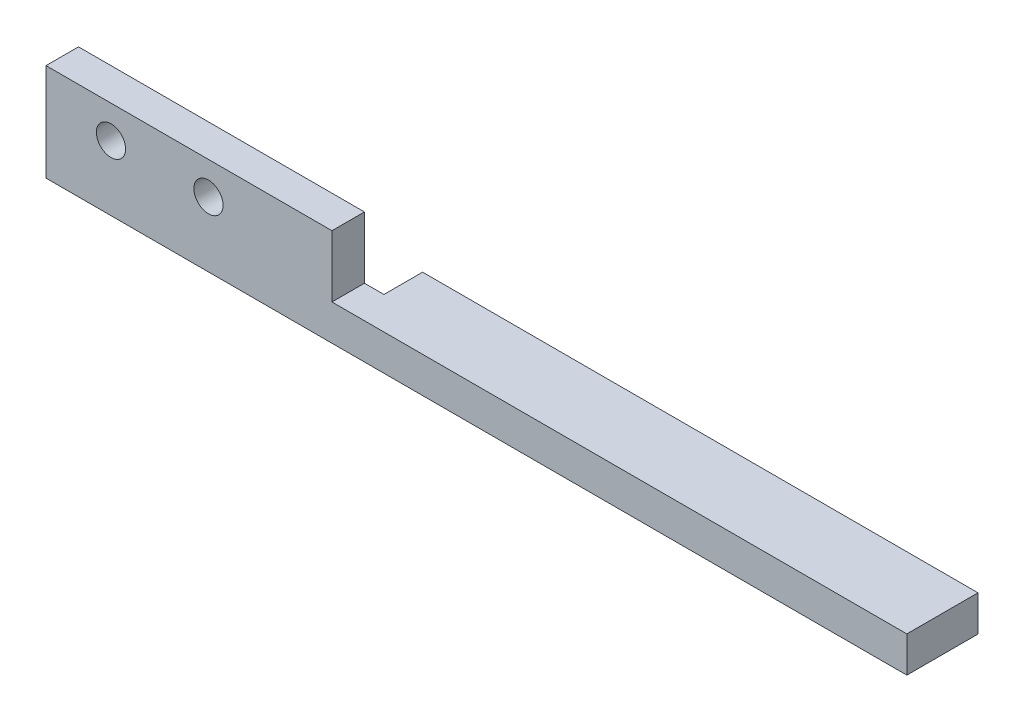
ISO-10303-21;
HEADER;
FILE_DESCRIPTION(('STEP AP214'),'2;1');
FILE_NAME('part.step','',(''),(''),'','','');
FILE_SCHEMA(('AUTOMOTIVE_DESIGN { 1 0 10303 214 1 1 1 1 }'));
ENDSEC;
DATA;
#1=APPLICATION_CONTEXT('core data for automotive mechanical design processes');
#2=APPLICATION_PROTOCOL_DEFINITION('international standard','automotive_design',2000,#1);
#3=PRODUCT_CONTEXT('',#1,'mechanical');
#4=PRODUCT('Part','Part','',(#3));
#5=PRODUCT_RELATED_PRODUCT_CATEGORY('part','',(#4));
#6=PRODUCT_DEFINITION_FORMATION('','',#4);
#7=PRODUCT_DEFINITION_CONTEXT('part definition',#1,'design');
#8=PRODUCT_DEFINITION('design','',#6,#7);
#9=PRODUCT_DEFINITION_SHAPE('','',#8);
#10=(LENGTH_UNIT() NAMED_UNIT(*) SI_UNIT(.MILLI.,.METRE.));
#11=(NAMED_UNIT(*) PLANE_ANGLE_UNIT() SI_UNIT($,.RADIAN.));
#12=(NAMED_UNIT(*) SI_UNIT($,.STERADIAN.) SOLID_ANGLE_UNIT());
#13=UNCERTAINTY_MEASURE_WITH_UNIT(LENGTH_MEASURE(1.E-05),#10,'distance_accuracy_value','');
#14=(GEOMETRIC_REPRESENTATION_CONTEXT(3) GLOBAL_UNCERTAINTY_ASSIGNED_CONTEXT((#13)) GLOBAL_UNIT_ASSIGNED_CONTEXT((#10,
#11,#12)) REPRESENTATION_CONTEXT('',''));
#15=CARTESIAN_POINT('',(0.,0.,0.));
#16=DIRECTION('',(0.,0.,1.));
#17=DIRECTION('',(1.,0.,0.));
#18=AXIS2_PLACEMENT_3D('',#15,#16,#17);
#19=CARTESIAN_POINT('',(0.,0.,-5.));
#20=DIRECTION('',(0.,0.,1.));
#21=DIRECTION('',(-1.,0.,0.));
#22=AXIS2_PLACEMENT_3D('',#19,#20,#21);
#23=PLANE('',#22);
#24=CARTESIAN_POINT('',(25.,5.,-5.));
#25=DIRECTION('',(0.,0.,-1.));
#26=DIRECTION('',(-1.,0.,0.));
#27=AXIS2_PLACEMENT_3D('',#24,#25,#26);
#28=CIRCLE('',#27,2.25);
#29=CARTESIAN_POINT('',(22.75,5.,-5.));
#30=VERTEX_POINT('',#29);
#31=EDGE_CURVE('E217',#30,#30,#28,.T.);
#32=ORIENTED_EDGE('',*,*,#31,.F.);
#33=EDGE_LOOP('',(#32));
#34=FACE_BOUND('',#33,.T.);
#35=CARTESIAN_POINT('',(10.,5.,-5.));
#36=DIRECTION('',(0.,0.,-1.));
#37=DIRECTION('',(-1.,0.,0.));
#38=AXIS2_PLACEMENT_3D('',#35,#36,#37);
#39=CIRCLE('',#38,2.25);
#40=CARTESIAN_POINT('',(7.75,5.,-5.));
#41=VERTEX_POINT('',#40);
#42=EDGE_CURVE('E111',#41,#41,#39,.T.);
#43=ORIENTED_EDGE('',*,*,#42,.F.);
#44=EDGE_LOOP('',(#43));
#45=FACE_BOUND('',#44,.T.);
#46=DIRECTION('',(1.,0.,0.));
#47=VECTOR('',#46,1.);
#48=CARTESIAN_POINT('',(0.,10.,-5.00000000000001));
#49=LINE('',#48,#47);
#50=CARTESIAN_POINT('',(0.,10.,-5.00000000000001));
#51=VERTEX_POINT('',#50);
#52=CARTESIAN_POINT('',(44.,10.,-5.00000000000001));
#53=VERTEX_POINT('',#52);
#54=EDGE_CURVE('E110',#51,#53,#49,.T.);
#55=ORIENTED_EDGE('',*,*,#54,.T.);
#56=DIRECTION('',(0.,1.,0.));
#57=VECTOR('',#56,1.);
#58=CARTESIAN_POINT('',(44.,15.,-5.00000000000001));
#59=LINE('',#58,#57);
#60=CARTESIAN_POINT('',(44.,0.5,-5.));
#61=VERTEX_POINT('',#60);
#62=EDGE_CURVE('E159',#61,#53,#59,.T.);
#63=ORIENTED_EDGE('',*,*,#62,.F.);
#64=DIRECTION('',(1.,0.,0.));
#65=VECTOR('',#64,1.);
#66=CARTESIAN_POINT('',(44.,0.5,-5.));
#67=LINE('',#66,#65);
#68=CARTESIAN_POINT('',(47.,0.5,-5.));
#69=VERTEX_POINT('',#68);
#70=EDGE_CURVE('E150',#61,#69,#67,.T.);
#71=ORIENTED_EDGE('',*,*,#70,.T.);
#72=DIRECTION('',(0.,-1.,0.));
#73=VECTOR('',#72,1.);
#74=CARTESIAN_POINT('',(47.,-5.00000000000001,-5.));
#75=LINE('',#74,#73);
#76=CARTESIAN_POINT('',(47.,-5.00000000000001,-5.));
#77=VERTEX_POINT('',#76);
#78=EDGE_CURVE('E136',#69,#77,#75,.T.);
#79=ORIENTED_EDGE('',*,*,#78,.T.);
#80=DIRECTION('',(-1.,0.,0.));
#81=VECTOR('',#80,1.);
#82=CARTESIAN_POINT('',(100.,-5.,-5.));
#83=LINE('',#82,#81);
#84=CARTESIAN_POINT('',(0.,-5.,-5.));
#85=VERTEX_POINT('',#84);
#86=EDGE_CURVE('E118',#77,#85,#83,.T.);
#87=ORIENTED_EDGE('',*,*,#86,.T.);
#88=DIRECTION('',(0.,-1.,0.));
#89=VECTOR('',#88,1.);
#90=CARTESIAN_POINT('',(0.,0.,-5.));
#91=LINE('',#90,#89);
#92=EDGE_CURVE('E11',#51,#85,#91,.T.);
#93=ORIENTED_EDGE('',*,*,#92,.F.);
#94=EDGE_LOOP('',(#55,#63,#71,#79,#87,#93));
#95=FACE_BOUND('',#94,.T.);
#96=ADVANCED_FACE('F37',(#34,#45,#95),#23,.F.);
#97=CARTESIAN_POINT('',(0.,0.,-5.));
#98=DIRECTION('',(1.,0.,0.));
#99=DIRECTION('',(0.,0.,1.));
#100=AXIS2_PLACEMENT_3D('',#97,#98,#99);
#101=PLANE('',#100);
#102=DIRECTION('',(0.,0.,-1.));
#103=VECTOR('',#102,1.);
#104=CARTESIAN_POINT('',(0.,10.,0.));
#105=LINE('',#104,#103);
#106=CARTESIAN_POINT('',(0.,10.,0.));
#107=VERTEX_POINT('',#106);
#108=EDGE_CURVE('E105',#107,#51,#105,.T.);
#109=ORIENTED_EDGE('',*,*,#108,.T.);
#110=ORIENTED_EDGE('',*,*,#92,.T.);
#111=DIRECTION('',(0.,0.,1.));
#112=VECTOR('',#111,1.);
#113=CARTESIAN_POINT('',(0.,-5.,-5.));
#114=LINE('',#113,#112);
#115=CARTESIAN_POINT('',(0.,-5.,0.));
#116=VERTEX_POINT('',#115);
#117=EDGE_CURVE('E156',#85,#116,#114,.T.);
#118=ORIENTED_EDGE('',*,*,#117,.T.);
#119=DIRECTION('',(0.,-1.,0.));
#120=VECTOR('',#119,1.);
#121=CARTESIAN_POINT('',(0.,0.,0.));
#122=LINE('',#121,#120);
#123=EDGE_CURVE('E41',#107,#116,#122,.T.);
#124=ORIENTED_EDGE('',*,*,#123,.F.);
#125=EDGE_LOOP('',(#109,#110,#118,#124));
#126=FACE_BOUND('',#125,.T.);
#127=ADVANCED_FACE('F39',(#126),#101,.F.);
#128=CARTESIAN_POINT('',(0.,0.,0.));
#129=DIRECTION('',(0.,0.,1.));
#130=DIRECTION('',(-1.,0.,0.));
#131=AXIS2_PLACEMENT_3D('',#128,#129,#130);
#132=PLANE('',#131);
#133=CARTESIAN_POINT('',(25.,5.,0.));
#134=DIRECTION('',(0.,0.,-1.));
#135=DIRECTION('',(1.,0.,0.));
#136=AXIS2_PLACEMENT_3D('',#133,#134,#135);
#137=CIRCLE('',#136,2.25);
#138=CARTESIAN_POINT('',(27.25,5.,0.));
#139=VERTEX_POINT('',#138);
#140=EDGE_CURVE('E212',#139,#139,#137,.T.);
#141=ORIENTED_EDGE('',*,*,#140,.T.);
#142=EDGE_LOOP('',(#141));
#143=FACE_BOUND('',#142,.T.);
#144=CARTESIAN_POINT('',(10.,5.,0.));
#145=DIRECTION('',(0.,0.,-1.));
#146=DIRECTION('',(-1.,0.,0.));
#147=AXIS2_PLACEMENT_3D('',#144,#145,#146);
#148=CIRCLE('',#147,2.25);
#149=CARTESIAN_POINT('',(7.75,5.,0.));
#150=VERTEX_POINT('',#149);
#151=EDGE_CURVE('E215',#150,#150,#148,.T.);
#152=ORIENTED_EDGE('',*,*,#151,.T.);
#153=EDGE_LOOP('',(#152));
#154=FACE_BOUND('',#153,.T.);
#155=ORIENTED_EDGE('',*,*,#123,.T.);
#156=DIRECTION('',(1.,0.,0.));
#157=VECTOR('',#156,1.);
#158=CARTESIAN_POINT('',(100.,-5.,0.));
#159=LINE('',#158,#157);
#160=CARTESIAN_POINT('',(132.46,-5.,0.));
#161=VERTEX_POINT('',#160);
#162=EDGE_CURVE('E164',#116,#161,#159,.T.);
#163=ORIENTED_EDGE('',*,*,#162,.T.);
#164=DIRECTION('',(0.,1.,0.));
#165=VECTOR('',#164,1.);
#166=CARTESIAN_POINT('',(132.46,0.5,0.));
#167=LINE('',#166,#165);
#168=CARTESIAN_POINT('',(132.46,0.5,0.));
#169=VERTEX_POINT('',#168);
#170=EDGE_CURVE('E126',#161,#169,#167,.T.);
#171=ORIENTED_EDGE('',*,*,#170,.T.);
#172=DIRECTION('',(-1.,0.,0.));
#173=VECTOR('',#172,1.);
#174=CARTESIAN_POINT('',(44.,0.5,0.));
#175=LINE('',#174,#173);
#176=CARTESIAN_POINT('',(44.,0.5,0.));
#177=VERTEX_POINT('',#176);
#178=EDGE_CURVE('E153',#169,#177,#175,.T.);
#179=ORIENTED_EDGE('',*,*,#178,.T.);
#180=DIRECTION('',(0.,1.,0.));
#181=VECTOR('',#180,1.);
#182=CARTESIAN_POINT('',(44.,15.,0.));
#183=LINE('',#182,#181);
#184=CARTESIAN_POINT('',(44.,10.,0.));
#185=VERTEX_POINT('',#184);
#186=EDGE_CURVE('E158',#177,#185,#183,.T.);
#187=ORIENTED_EDGE('',*,*,#186,.T.);
#188=DIRECTION('',(-1.,0.,0.));
#189=VECTOR('',#188,1.);
#190=CARTESIAN_POINT('',(0.,10.,0.));
#191=LINE('',#190,#189);
#192=EDGE_CURVE('E121',#185,#107,#191,.T.);
#193=ORIENTED_EDGE('',*,*,#192,.T.);
#194=EDGE_LOOP('',(#155,#163,#171,#179,#187,#193));
#195=FACE_BOUND('',#194,.T.);
#196=ADVANCED_FACE('F167',(#143,#154,#195),#132,.T.);
#197=CARTESIAN_POINT('',(44.,15.,-5.00000000000001));
#198=DIRECTION('',(-1.,0.,0.));
#199=DIRECTION('',(0.,0.,-1.));
#200=AXIS2_PLACEMENT_3D('',#197,#198,#199);
#201=PLANE('',#200);
#202=DIRECTION('',(0.,0.,1.));
#203=VECTOR('',#202,1.);
#204=CARTESIAN_POINT('',(44.,10.,0.));
#205=LINE('',#204,#203);
#206=EDGE_CURVE('E52',#53,#185,#205,.T.);
#207=ORIENTED_EDGE('',*,*,#206,.T.);
#208=ORIENTED_EDGE('',*,*,#186,.F.);
#209=DIRECTION('',(0.,0.,-1.));
#210=VECTOR('',#209,1.);
#211=CARTESIAN_POINT('',(44.,0.5,0.));
#212=LINE('',#211,#210);
#213=EDGE_CURVE('E148',#177,#61,#212,.T.);
#214=ORIENTED_EDGE('',*,*,#213,.T.);
#215=ORIENTED_EDGE('',*,*,#62,.T.);
#216=EDGE_LOOP('',(#207,#208,#214,#215));
#217=FACE_BOUND('',#216,.T.);
#218=ADVANCED_FACE('F180',(#217),#201,.F.);
#219=CARTESIAN_POINT('',(0.,-5.,0.));
#220=DIRECTION('',(0.,-1.,0.));
#221=DIRECTION('',(0.,0.,1.));
#222=AXIS2_PLACEMENT_3D('',#219,#220,#221);
#223=PLANE('',#222);
#224=ORIENTED_EDGE('',*,*,#162,.F.);
#225=ORIENTED_EDGE('',*,*,#117,.F.);
#226=ORIENTED_EDGE('',*,*,#86,.F.);
#227=DIRECTION('',(0.,0.,1.));
#228=VECTOR('',#227,1.);
#229=CARTESIAN_POINT('',(47.,-5.00000000000001,-10.95));
#230=LINE('',#229,#228);
#231=CARTESIAN_POINT('',(47.,-5.00000000000001,-10.95));
#232=VERTEX_POINT('',#231);
#233=EDGE_CURVE('E144',#232,#77,#230,.T.);
#234=ORIENTED_EDGE('',*,*,#233,.F.);
#235=DIRECTION('',(1.,0.,0.));
#236=VECTOR('',#235,1.);
#237=CARTESIAN_POINT('',(100.,-5.,-10.95));
#238=LINE('',#237,#236);
#239=CARTESIAN_POINT('',(132.46,-5.,-10.95));
#240=VERTEX_POINT('',#239);
#241=EDGE_CURVE('E141',#232,#240,#238,.T.);
#242=ORIENTED_EDGE('',*,*,#241,.T.);
#243=DIRECTION('',(0.,0.,1.));
#244=VECTOR('',#243,1.);
#245=CARTESIAN_POINT('',(132.46,-5.,0.));
#246=LINE('',#245,#244);
#247=EDGE_CURVE('E134',#240,#161,#246,.T.);
#248=ORIENTED_EDGE('',*,*,#247,.T.);
#249=EDGE_LOOP('',(#224,#225,#226,#234,#242,#248));
#250=FACE_BOUND('',#249,.T.);
#251=ADVANCED_FACE('F169',(#250),#223,.T.);
#252=CARTESIAN_POINT('',(0.,0.5,0.));
#253=DIRECTION('',(0.,1.,0.));
#254=DIRECTION('',(0.,0.,-1.));
#255=AXIS2_PLACEMENT_3D('',#252,#253,#254);
#256=PLANE('',#255);
#257=ORIENTED_EDGE('',*,*,#213,.F.);
#258=ORIENTED_EDGE('',*,*,#178,.F.);
#259=DIRECTION('',(0.,0.,-1.));
#260=VECTOR('',#259,1.);
#261=CARTESIAN_POINT('',(132.46,0.5,0.));
#262=LINE('',#261,#260);
#263=CARTESIAN_POINT('',(132.46,0.5,-10.95));
#264=VERTEX_POINT('',#263);
#265=EDGE_CURVE('E129',#169,#264,#262,.T.);
#266=ORIENTED_EDGE('',*,*,#265,.T.);
#267=DIRECTION('',(-1.,0.,0.));
#268=VECTOR('',#267,1.);
#269=CARTESIAN_POINT('',(100.,0.5,-10.95));
#270=LINE('',#269,#268);
#271=CARTESIAN_POINT('',(47.,0.5,-10.95));
#272=VERTEX_POINT('',#271);
#273=EDGE_CURVE('E137',#264,#272,#270,.T.);
#274=ORIENTED_EDGE('',*,*,#273,.T.);
#275=DIRECTION('',(0.,0.,1.));
#276=VECTOR('',#275,1.);
#277=CARTESIAN_POINT('',(47.,0.5,-10.95));
#278=LINE('',#277,#276);
#279=EDGE_CURVE('E60',#272,#69,#278,.T.);
#280=ORIENTED_EDGE('',*,*,#279,.T.);
#281=ORIENTED_EDGE('',*,*,#70,.F.);
#282=EDGE_LOOP('',(#257,#258,#266,#274,#280,#281));
#283=FACE_BOUND('',#282,.T.);
#284=ADVANCED_FACE('F178',(#283),#256,.T.);
#285=CARTESIAN_POINT('',(47.,-5.00000000000001,-10.95));
#286=DIRECTION('',(1.,0.,0.));
#287=DIRECTION('',(0.,0.,1.));
#288=AXIS2_PLACEMENT_3D('',#285,#286,#287);
#289=PLANE('',#288);
#290=ORIENTED_EDGE('',*,*,#78,.F.);
#291=ORIENTED_EDGE('',*,*,#279,.F.);
#292=DIRECTION('',(0.,-1.,0.));
#293=VECTOR('',#292,1.);
#294=CARTESIAN_POINT('',(47.,-5.00000000000001,-10.95));
#295=LINE('',#294,#293);
#296=EDGE_CURVE('E139',#272,#232,#295,.T.);
#297=ORIENTED_EDGE('',*,*,#296,.T.);
#298=ORIENTED_EDGE('',*,*,#233,.T.);
#299=EDGE_LOOP('',(#290,#291,#297,#298));
#300=FACE_BOUND('',#299,.T.);
#301=ADVANCED_FACE('F182',(#300),#289,.F.);
#302=CARTESIAN_POINT('',(0.,0.,-10.95));
#303=DIRECTION('',(0.,0.,-1.));
#304=DIRECTION('',(1.,0.,0.));
#305=AXIS2_PLACEMENT_3D('',#302,#303,#304);
#306=PLANE('',#305);
#307=ORIENTED_EDGE('',*,*,#241,.F.);
#308=ORIENTED_EDGE('',*,*,#296,.F.);
#309=ORIENTED_EDGE('',*,*,#273,.F.);
#310=DIRECTION('',(0.,-1.,0.));
#311=VECTOR('',#310,1.);
#312=CARTESIAN_POINT('',(132.46,0.5,-10.95));
#313=LINE('',#312,#311);
#314=EDGE_CURVE('E132',#264,#240,#313,.T.);
#315=ORIENTED_EDGE('',*,*,#314,.T.);
#316=EDGE_LOOP('',(#307,#308,#309,#315));
#317=FACE_BOUND('',#316,.T.);
#318=ADVANCED_FACE('F185',(#317),#306,.T.);
#319=CARTESIAN_POINT('',(132.46,0.,0.));
#320=DIRECTION('',(-1.,0.,0.));
#321=DIRECTION('',(0.,0.,-1.));
#322=AXIS2_PLACEMENT_3D('',#319,#320,#321);
#323=PLANE('',#322);
#324=ORIENTED_EDGE('',*,*,#170,.F.);
#325=ORIENTED_EDGE('',*,*,#247,.F.);
#326=ORIENTED_EDGE('',*,*,#314,.F.);
#327=ORIENTED_EDGE('',*,*,#265,.F.);
#328=EDGE_LOOP('',(#324,#325,#326,#327));
#329=FACE_BOUND('',#328,.T.);
#330=ADVANCED_FACE('F175',(#329),#323,.F.);
#331=CARTESIAN_POINT('',(0.,10.,0.));
#332=DIRECTION('',(0.,1.,0.));
#333=DIRECTION('',(0.,0.,-1.));
#334=AXIS2_PLACEMENT_3D('',#331,#332,#333);
#335=PLANE('',#334);
#336=ORIENTED_EDGE('',*,*,#108,.F.);
#337=ORIENTED_EDGE('',*,*,#192,.F.);
#338=ORIENTED_EDGE('',*,*,#206,.F.);
#339=ORIENTED_EDGE('',*,*,#54,.F.);
#340=EDGE_LOOP('',(#336,#337,#338,#339));
#341=FACE_BOUND('',#340,.T.);
#342=ADVANCED_FACE('F119',(#341),#335,.T.);
#343=CARTESIAN_POINT('',(10.,5.,-15.));
#344=DIRECTION('',(0.,0.,1.));
#345=DIRECTION('',(-1.,0.,0.));
#346=AXIS2_PLACEMENT_3D('',#343,#344,#345);
#347=CYLINDRICAL_SURFACE('',#346,2.25);
#348=ORIENTED_EDGE('',*,*,#151,.F.);
#349=EDGE_LOOP('',(#348));
#350=FACE_BOUND('',#349,.T.);
#351=ORIENTED_EDGE('',*,*,#42,.T.);
#352=EDGE_LOOP('',(#351));
#353=FACE_BOUND('',#352,.T.);
#354=ADVANCED_FACE('F226',(#350,#353),#347,.F.);
#355=CARTESIAN_POINT('',(25.,5.,-15.));
#356=DIRECTION('',(0.,0.,1.));
#357=DIRECTION('',(-1.,0.,0.));
#358=AXIS2_PLACEMENT_3D('',#355,#356,#357);
#359=CYLINDRICAL_SURFACE('',#358,2.25);
#360=ORIENTED_EDGE('',*,*,#140,.F.);
#361=EDGE_LOOP('',(#360));
#362=FACE_BOUND('',#361,.T.);
#363=ORIENTED_EDGE('',*,*,#31,.T.);
#364=EDGE_LOOP('',(#363));
#365=FACE_BOUND('',#364,.T.);
#366=ADVANCED_FACE('F224',(#362,#365),#359,.F.);
#367=CLOSED_SHELL('',(#96,#127,#196,#218,#251,#284,#301,#318,#330,#342,#354,#366));
#368=MANIFOLD_SOLID_BREP('B2',#367);
#369=ADVANCED_BREP_SHAPE_REPRESENTATION('',(#18,#368),#14);
#370=SHAPE_DEFINITION_REPRESENTATION(#9,#369);
ENDSEC;
END-ISO-10303-21;
